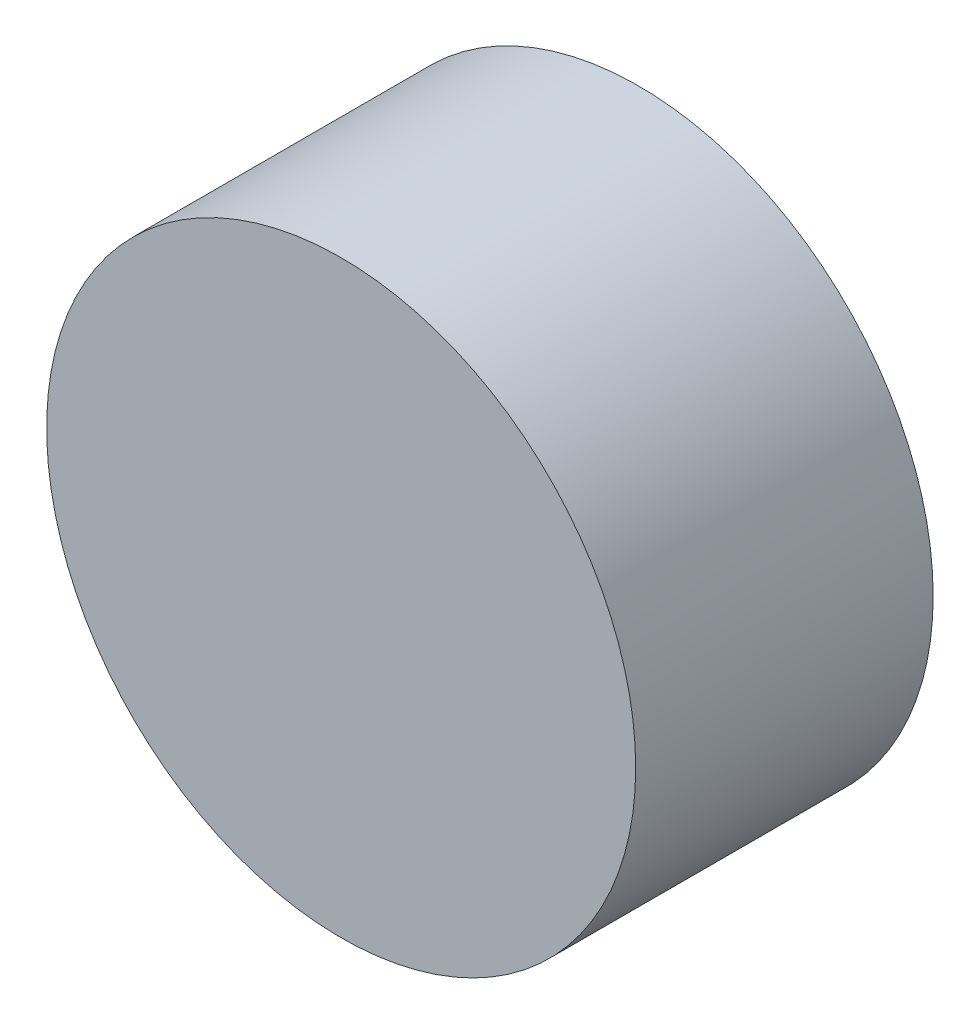
ISO-10303-21;
HEADER;
FILE_DESCRIPTION(('STEP AP214'),'2;1');
FILE_NAME('part.step','',(''),(''),'','','');
FILE_SCHEMA(('AUTOMOTIVE_DESIGN { 1 0 10303 214 1 1 1 1 }'));
ENDSEC;
DATA;
#1=APPLICATION_CONTEXT('core data for automotive mechanical design processes');
#2=APPLICATION_PROTOCOL_DEFINITION('international standard','automotive_design',2000,#1);
#3=PRODUCT_CONTEXT('',#1,'mechanical');
#4=PRODUCT('Part','Part','',(#3));
#5=PRODUCT_RELATED_PRODUCT_CATEGORY('part','',(#4));
#6=PRODUCT_DEFINITION_FORMATION('','',#4);
#7=PRODUCT_DEFINITION_CONTEXT('part definition',#1,'design');
#8=PRODUCT_DEFINITION('design','',#6,#7);
#9=PRODUCT_DEFINITION_SHAPE('','',#8);
#10=(LENGTH_UNIT() NAMED_UNIT(*) SI_UNIT(.MILLI.,.METRE.));
#11=(NAMED_UNIT(*) PLANE_ANGLE_UNIT() SI_UNIT($,.RADIAN.));
#12=(NAMED_UNIT(*) SI_UNIT($,.STERADIAN.) SOLID_ANGLE_UNIT());
#13=UNCERTAINTY_MEASURE_WITH_UNIT(LENGTH_MEASURE(1.E-05),#10,'distance_accuracy_value','');
#14=(GEOMETRIC_REPRESENTATION_CONTEXT(3) GLOBAL_UNCERTAINTY_ASSIGNED_CONTEXT((#13)) GLOBAL_UNIT_ASSIGNED_CONTEXT((#10,
#11,#12)) REPRESENTATION_CONTEXT('',''));
#15=CARTESIAN_POINT('',(0.,0.,0.));
#16=DIRECTION('',(0.,0.,1.));
#17=DIRECTION('',(1.,0.,0.));
#18=AXIS2_PLACEMENT_3D('',#15,#16,#17);
#19=CARTESIAN_POINT('',(0.,0.,1.52));
#20=DIRECTION('',(0.,0.,-1.));
#21=DIRECTION('',(-1.,0.,0.));
#22=AXIS2_PLACEMENT_3D('',#19,#20,#21);
#23=CYLINDRICAL_SURFACE('',#22,1.505);
#24=CARTESIAN_POINT('',(0.,0.,1.52));
#25=DIRECTION('',(0.,0.,1.));
#26=DIRECTION('',(1.,0.,0.));
#27=AXIS2_PLACEMENT_3D('',#24,#25,#26);
#28=CIRCLE('',#27,1.505);
#29=CARTESIAN_POINT('',(1.505,0.,1.52));
#30=VERTEX_POINT('',#29);
#31=EDGE_CURVE('E10',#30,#30,#28,.T.);
#32=ORIENTED_EDGE('',*,*,#31,.F.);
#33=EDGE_LOOP('',(#32));
#34=FACE_BOUND('',#33,.T.);
#35=CARTESIAN_POINT('',(0.,0.,0.));
#36=DIRECTION('',(0.,0.,1.));
#37=DIRECTION('',(1.,0.,0.));
#38=AXIS2_PLACEMENT_3D('',#35,#36,#37);
#39=CIRCLE('',#38,1.505);
#40=CARTESIAN_POINT('',(1.505,0.,0.));
#41=VERTEX_POINT('',#40);
#42=EDGE_CURVE('E34',#41,#41,#39,.T.);
#43=ORIENTED_EDGE('',*,*,#42,.T.);
#44=EDGE_LOOP('',(#43));
#45=FACE_BOUND('',#44,.T.);
#46=ADVANCED_FACE('F31',(#34,#45),#23,.T.);
#47=CARTESIAN_POINT('',(0.,0.,1.52));
#48=DIRECTION('',(0.,0.,1.));
#49=DIRECTION('',(1.,0.,0.));
#50=AXIS2_PLACEMENT_3D('',#47,#48,#49);
#51=PLANE('',#50);
#52=ORIENTED_EDGE('',*,*,#31,.T.);
#53=EDGE_LOOP('',(#52));
#54=FACE_BOUND('',#53,.T.);
#55=ADVANCED_FACE('F46',(#54),#51,.T.);
#56=CARTESIAN_POINT('',(0.,0.,0.));
#57=DIRECTION('',(0.,0.,1.));
#58=DIRECTION('',(1.,0.,0.));
#59=AXIS2_PLACEMENT_3D('',#56,#57,#58);
#60=PLANE('',#59);
#61=ORIENTED_EDGE('',*,*,#42,.F.);
#62=EDGE_LOOP('',(#61));
#63=FACE_BOUND('',#62,.T.);
#64=ADVANCED_FACE('F44',(#63),#60,.F.);
#65=CLOSED_SHELL('',(#46,#55,#64));
#66=MANIFOLD_SOLID_BREP('B2',#65);
#67=ADVANCED_BREP_SHAPE_REPRESENTATION('',(#18,#66),#14);
#68=SHAPE_DEFINITION_REPRESENTATION(#9,#67);
ENDSEC;
END-ISO-10303-21;
